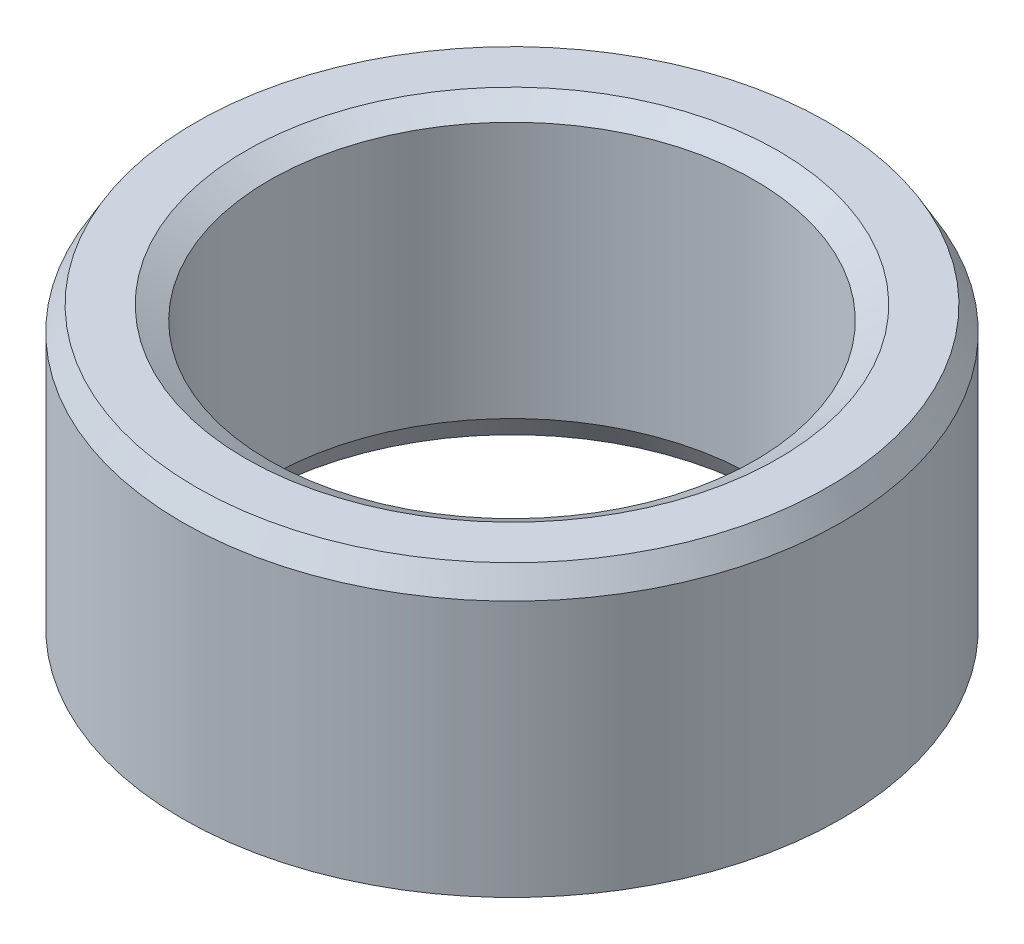
ISO-10303-21;
HEADER;
FILE_DESCRIPTION(('STEP AP214'),'2;1');
FILE_NAME('part.step','',(''),(''),'','','');
FILE_SCHEMA(('AUTOMOTIVE_DESIGN { 1 0 10303 214 1 1 1 1 }'));
ENDSEC;
DATA;
#1=APPLICATION_CONTEXT('core data for automotive mechanical design processes');
#2=APPLICATION_PROTOCOL_DEFINITION('international standard','automotive_design',2000,#1);
#3=PRODUCT_CONTEXT('',#1,'mechanical');
#4=PRODUCT('Part','Part','',(#3));
#5=PRODUCT_RELATED_PRODUCT_CATEGORY('part','',(#4));
#6=PRODUCT_DEFINITION_FORMATION('','',#4);
#7=PRODUCT_DEFINITION_CONTEXT('part definition',#1,'design');
#8=PRODUCT_DEFINITION('design','',#6,#7);
#9=PRODUCT_DEFINITION_SHAPE('','',#8);
#10=(LENGTH_UNIT() NAMED_UNIT(*) SI_UNIT(.MILLI.,.METRE.));
#11=(NAMED_UNIT(*) PLANE_ANGLE_UNIT() SI_UNIT($,.RADIAN.));
#12=(NAMED_UNIT(*) SI_UNIT($,.STERADIAN.) SOLID_ANGLE_UNIT());
#13=UNCERTAINTY_MEASURE_WITH_UNIT(LENGTH_MEASURE(1.E-05),#10,'distance_accuracy_value','');
#14=(GEOMETRIC_REPRESENTATION_CONTEXT(3) GLOBAL_UNCERTAINTY_ASSIGNED_CONTEXT((#13)) GLOBAL_UNIT_ASSIGNED_CONTEXT((#10,
#11,#12)) REPRESENTATION_CONTEXT('',''));
#15=CARTESIAN_POINT('',(0.,0.,0.));
#16=DIRECTION('',(0.,0.,1.));
#17=DIRECTION('',(1.,0.,0.));
#18=AXIS2_PLACEMENT_3D('',#15,#16,#17);
#19=CARTESIAN_POINT('',(0.,35.6604166353891,0.));
#20=DIRECTION('',(0.,-1.,0.));
#21=DIRECTION('',(0.,0.,-1.));
#22=AXIS2_PLACEMENT_3D('',#19,#20,#21);
#23=CYLINDRICAL_SURFACE('',#22,40.);
#24=CARTESIAN_POINT('',(0.,1.65713921646456,0.));
#25=DIRECTION('',(0.,1.,0.));
#26=DIRECTION('',(0.,0.,1.));
#27=AXIS2_PLACEMENT_3D('',#24,#25,#26);
#28=CIRCLE('',#27,40.);
#29=CARTESIAN_POINT('',(0.,1.65713921646456,40.));
#30=VERTEX_POINT('',#29);
#31=EDGE_CURVE('E10',#30,#30,#28,.T.);
#32=ORIENTED_EDGE('',*,*,#31,.T.);
#33=EDGE_LOOP('',(#32));
#34=FACE_BOUND('',#33,.T.);
#35=CARTESIAN_POINT('',(0.,32.7901673172575,0.));
#36=DIRECTION('',(0.,1.,0.));
#37=DIRECTION('',(0.,0.,1.));
#38=AXIS2_PLACEMENT_3D('',#35,#36,#37);
#39=CIRCLE('',#38,40.);
#40=CARTESIAN_POINT('',(0.,32.7901673172575,40.));
#41=VERTEX_POINT('',#40);
#42=EDGE_CURVE('E50',#41,#41,#39,.F.);
#43=ORIENTED_EDGE('',*,*,#42,.T.);
#44=EDGE_LOOP('',(#43));
#45=FACE_BOUND('',#44,.T.);
#46=ADVANCED_FACE('F39',(#34,#45),#23,.T.);
#47=CARTESIAN_POINT('',(0.,35.6604166353891,0.));
#48=DIRECTION('',(0.,1.,0.));
#49=DIRECTION('',(0.,0.,1.));
#50=AXIS2_PLACEMENT_3D('',#47,#48,#49);
#51=PLANE('',#50);
#52=CARTESIAN_POINT('',(0.,35.6604166353891,0.));
#53=DIRECTION('',(0.,1.,0.));
#54=DIRECTION('',(0.,0.,1.));
#55=AXIS2_PLACEMENT_3D('',#52,#53,#54);
#56=CIRCLE('',#55,32.3235720284628);
#57=CARTESIAN_POINT('',(0.,35.6604166353891,32.3235720284628));
#58=VERTEX_POINT('',#57);
#59=EDGE_CURVE('E58',#58,#58,#56,.F.);
#60=ORIENTED_EDGE('',*,*,#59,.T.);
#61=EDGE_LOOP('',(#60));
#62=FACE_BOUND('',#61,.T.);
#63=CARTESIAN_POINT('',(0.,35.6604166353891,0.));
#64=DIRECTION('',(0.,1.,0.));
#65=DIRECTION('',(0.,0.,1.));
#66=AXIS2_PLACEMENT_3D('',#63,#64,#65);
#67=CIRCLE('',#66,38.3428607835354);
#68=CARTESIAN_POINT('',(0.,35.6604166353891,38.3428607835354));
#69=VERTEX_POINT('',#68);
#70=EDGE_CURVE('E61',#69,#69,#67,.T.);
#71=ORIENTED_EDGE('',*,*,#70,.T.);
#72=EDGE_LOOP('',(#71));
#73=FACE_BOUND('',#72,.T.);
#74=ADVANCED_FACE('F88',(#62,#73),#51,.T.);
#75=CARTESIAN_POINT('',(0.,0.,0.));
#76=DIRECTION('',(0.,1.,0.));
#77=DIRECTION('',(0.,0.,1.));
#78=AXIS2_PLACEMENT_3D('',#75,#76,#77);
#79=PLANE('',#78);
#80=CARTESIAN_POINT('',(0.,0.,0.));
#81=DIRECTION('',(0.,1.,0.));
#82=DIRECTION('',(0.,0.,1.));
#83=AXIS2_PLACEMENT_3D('',#80,#81,#82);
#84=CIRCLE('',#83,31.1104619267958);
#85=CARTESIAN_POINT('',(0.,0.,31.1104619267958));
#86=VERTEX_POINT('',#85);
#87=EDGE_CURVE('E51',#86,#86,#84,.T.);
#88=ORIENTED_EDGE('',*,*,#87,.T.);
#89=EDGE_LOOP('',(#88));
#90=FACE_BOUND('',#89,.T.);
#91=CARTESIAN_POINT('',(0.,0.,0.));
#92=DIRECTION('',(0.,1.,0.));
#93=DIRECTION('',(0.,0.,1.));
#94=AXIS2_PLACEMENT_3D('',#91,#92,#93);
#95=CIRCLE('',#94,37.1297506818685);
#96=CARTESIAN_POINT('',(0.,0.,37.1297506818685));
#97=VERTEX_POINT('',#96);
#98=EDGE_CURVE('E54',#97,#97,#95,.F.);
#99=ORIENTED_EDGE('',*,*,#98,.T.);
#100=EDGE_LOOP('',(#99));
#101=FACE_BOUND('',#100,.T.);
#102=ADVANCED_FACE('F83',(#90,#101),#79,.F.);
#103=CARTESIAN_POINT('',(0.,35.6604166353891,0.));
#104=DIRECTION('',(0.,-1.,0.));
#105=DIRECTION('',(0.,0.,-1.));
#106=AXIS2_PLACEMENT_3D('',#103,#104,#105);
#107=CYLINDRICAL_SURFACE('',#106,29.4533227103312);
#108=CARTESIAN_POINT('',(0.,34.0032774189245,0.));
#109=DIRECTION('',(0.,1.,0.));
#110=DIRECTION('',(0.,0.,1.));
#111=AXIS2_PLACEMENT_3D('',#108,#109,#110);
#112=CIRCLE('',#111,29.4533227103312);
#113=CARTESIAN_POINT('',(0.,34.0032774189245,29.4533227103312));
#114=VERTEX_POINT('',#113);
#115=EDGE_CURVE('E67',#114,#114,#112,.T.);
#116=ORIENTED_EDGE('',*,*,#115,.T.);
#117=EDGE_LOOP('',(#116));
#118=FACE_BOUND('',#117,.T.);
#119=CARTESIAN_POINT('',(0.,2.87024931813155,0.));
#120=DIRECTION('',(0.,1.,0.));
#121=DIRECTION('',(0.,0.,1.));
#122=AXIS2_PLACEMENT_3D('',#119,#120,#121);
#123=CIRCLE('',#122,29.4533227103312);
#124=CARTESIAN_POINT('',(0.,2.87024931813155,29.4533227103312));
#125=VERTEX_POINT('',#124);
#126=EDGE_CURVE('E69',#125,#125,#123,.F.);
#127=ORIENTED_EDGE('',*,*,#126,.T.);
#128=EDGE_LOOP('',(#127));
#129=FACE_BOUND('',#128,.T.);
#130=ADVANCED_FACE('F71',(#118,#129),#107,.F.);
#131=CARTESIAN_POINT('',(0.,34.0032774189245,0.));
#132=DIRECTION('',(0.,1.,0.));
#133=DIRECTION('',(0.,0.,1.));
#134=AXIS2_PLACEMENT_3D('',#131,#132,#133);
#135=CONICAL_SURFACE('',#134,29.4533227103312,1.0471975511966);
#136=ORIENTED_EDGE('',*,*,#59,.F.);
#137=EDGE_LOOP('',(#136));
#138=FACE_BOUND('',#137,.T.);
#139=ORIENTED_EDGE('',*,*,#115,.F.);
#140=EDGE_LOOP('',(#139));
#141=FACE_BOUND('',#140,.T.);
#142=ADVANCED_FACE('F77',(#138,#141),#135,.F.);
#143=CARTESIAN_POINT('',(0.,0.,0.));
#144=DIRECTION('',(0.,-1.,0.));
#145=DIRECTION('',(0.,0.,-1.));
#146=AXIS2_PLACEMENT_3D('',#143,#144,#145);
#147=CONICAL_SURFACE('',#146,31.1104619267958,0.523598775598295);
#148=ORIENTED_EDGE('',*,*,#126,.F.);
#149=EDGE_LOOP('',(#148));
#150=FACE_BOUND('',#149,.T.);
#151=ORIENTED_EDGE('',*,*,#87,.F.);
#152=EDGE_LOOP('',(#151));
#153=FACE_BOUND('',#152,.T.);
#154=ADVANCED_FACE('F73',(#150,#153),#147,.F.);
#155=CARTESIAN_POINT('',(0.,1.65713921646456,0.));
#156=DIRECTION('',(0.,1.,0.));
#157=DIRECTION('',(0.,0.,1.));
#158=AXIS2_PLACEMENT_3D('',#155,#156,#157);
#159=CONICAL_SURFACE('',#158,40.,1.0471975511966);
#160=ORIENTED_EDGE('',*,*,#98,.F.);
#161=EDGE_LOOP('',(#160));
#162=FACE_BOUND('',#161,.T.);
#163=ORIENTED_EDGE('',*,*,#31,.F.);
#164=EDGE_LOOP('',(#163));
#165=FACE_BOUND('',#164,.T.);
#166=ADVANCED_FACE('F76',(#162,#165),#159,.T.);
#167=CARTESIAN_POINT('',(0.,35.6604166353891,0.));
#168=DIRECTION('',(0.,-1.,0.));
#169=DIRECTION('',(0.,0.,-1.));
#170=AXIS2_PLACEMENT_3D('',#167,#168,#169);
#171=CONICAL_SURFACE('',#170,38.3428607835354,0.523598775598299);
#172=ORIENTED_EDGE('',*,*,#42,.F.);
#173=EDGE_LOOP('',(#172));
#174=FACE_BOUND('',#173,.T.);
#175=ORIENTED_EDGE('',*,*,#70,.F.);
#176=EDGE_LOOP('',(#175));
#177=FACE_BOUND('',#176,.T.);
#178=ADVANCED_FACE('F45',(#174,#177),#171,.T.);
#179=CLOSED_SHELL('',(#46,#74,#102,#130,#142,#154,#166,#178));
#180=MANIFOLD_SOLID_BREP('B2',#179);
#181=ADVANCED_BREP_SHAPE_REPRESENTATION('',(#18,#180),#14);
#182=SHAPE_DEFINITION_REPRESENTATION(#9,#181);
ENDSEC;
END-ISO-10303-21;
